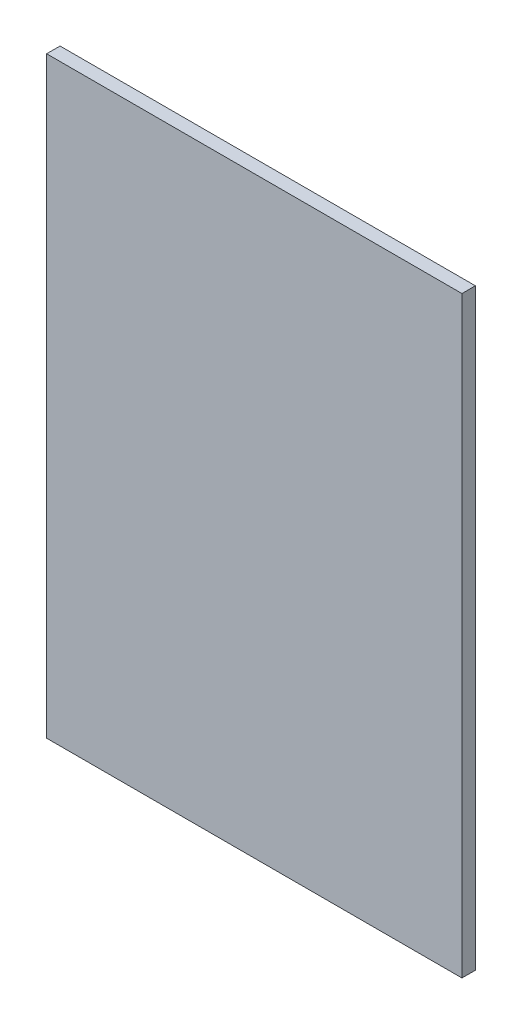
ISO-10303-21;
HEADER;
FILE_DESCRIPTION(('STEP AP214'),'2;1');
FILE_NAME('part.step','',(''),(''),'','','');
FILE_SCHEMA(('AUTOMOTIVE_DESIGN { 1 0 10303 214 1 1 1 1 }'));
ENDSEC;
DATA;
#1=APPLICATION_CONTEXT('core data for automotive mechanical design processes');
#2=APPLICATION_PROTOCOL_DEFINITION('international standard','automotive_design',2000,#1);
#3=PRODUCT_CONTEXT('',#1,'mechanical');
#4=PRODUCT('Part','Part','',(#3));
#5=PRODUCT_RELATED_PRODUCT_CATEGORY('part','',(#4));
#6=PRODUCT_DEFINITION_FORMATION('','',#4);
#7=PRODUCT_DEFINITION_CONTEXT('part definition',#1,'design');
#8=PRODUCT_DEFINITION('design','',#6,#7);
#9=PRODUCT_DEFINITION_SHAPE('','',#8);
#10=(LENGTH_UNIT() NAMED_UNIT(*) SI_UNIT(.MILLI.,.METRE.));
#11=(NAMED_UNIT(*) PLANE_ANGLE_UNIT() SI_UNIT($,.RADIAN.));
#12=(NAMED_UNIT(*) SI_UNIT($,.STERADIAN.) SOLID_ANGLE_UNIT());
#13=UNCERTAINTY_MEASURE_WITH_UNIT(LENGTH_MEASURE(1.E-05),#10,'distance_accuracy_value','');
#14=(GEOMETRIC_REPRESENTATION_CONTEXT(3) GLOBAL_UNCERTAINTY_ASSIGNED_CONTEXT((#13)) GLOBAL_UNIT_ASSIGNED_CONTEXT((#10,
#11,#12)) REPRESENTATION_CONTEXT('',''));
#15=CARTESIAN_POINT('',(0.,0.,0.));
#16=DIRECTION('',(0.,0.,1.));
#17=DIRECTION('',(1.,0.,0.));
#18=AXIS2_PLACEMENT_3D('',#15,#16,#17);
#19=CARTESIAN_POINT('',(94.9570007324219,93.4720001220703,0.));
#20=DIRECTION('',(1.,0.,0.));
#21=DIRECTION('',(0.,-1.,0.));
#22=AXIS2_PLACEMENT_3D('',#19,#20,#21);
#23=PLANE('',#22);
#24=DIRECTION('',(0.,-1.,0.));
#25=VECTOR('',#24,1.);
#26=CARTESIAN_POINT('',(94.9570007324219,93.4720001220703,0.03556));
#27=LINE('',#26,#25);
#28=CARTESIAN_POINT('',(94.9570007324219,93.4720001220703,0.03556));
#29=VERTEX_POINT('',#28);
#30=CARTESIAN_POINT('',(94.9570007324219,91.9020004272461,0.03556));
#31=VERTEX_POINT('',#30);
#32=EDGE_CURVE('E11',#29,#31,#27,.T.);
#33=ORIENTED_EDGE('',*,*,#32,.F.);
#34=DIRECTION('',(0.,0.,1.));
#35=VECTOR('',#34,1.);
#36=CARTESIAN_POINT('',(94.9570007324219,93.4720001220703,0.));
#37=LINE('',#36,#35);
#38=CARTESIAN_POINT('',(94.9570007324219,93.4720001220703,0.));
#39=VERTEX_POINT('',#38);
#40=EDGE_CURVE('E24',#39,#29,#37,.T.);
#41=ORIENTED_EDGE('',*,*,#40,.F.);
#42=DIRECTION('',(0.,-1.,0.));
#43=VECTOR('',#42,1.);
#44=CARTESIAN_POINT('',(94.9570007324219,93.4720001220703,0.));
#45=LINE('',#44,#43);
#46=CARTESIAN_POINT('',(94.9570007324219,91.9020004272461,0.));
#47=VERTEX_POINT('',#46);
#48=EDGE_CURVE('E75',#39,#47,#45,.T.);
#49=ORIENTED_EDGE('',*,*,#48,.T.);
#50=DIRECTION('',(0.,0.,1.));
#51=VECTOR('',#50,1.);
#52=CARTESIAN_POINT('',(94.9570007324219,91.9020004272461,0.));
#53=LINE('',#52,#51);
#54=EDGE_CURVE('E37',#47,#31,#53,.T.);
#55=ORIENTED_EDGE('',*,*,#54,.T.);
#56=EDGE_LOOP('',(#33,#41,#49,#55));
#57=FACE_BOUND('',#56,.T.);
#58=ADVANCED_FACE('F17',(#57),#23,.F.);
#59=CARTESIAN_POINT('',(94.9570007324219,91.9020004272461,0.));
#60=DIRECTION('',(0.,1.,0.));
#61=DIRECTION('',(1.,0.,0.));
#62=AXIS2_PLACEMENT_3D('',#59,#60,#61);
#63=PLANE('',#62);
#64=DIRECTION('',(1.,0.,0.));
#65=VECTOR('',#64,1.);
#66=CARTESIAN_POINT('',(94.9570007324219,91.9020004272461,0.03556));
#67=LINE('',#66,#65);
#68=CARTESIAN_POINT('',(96.056999206543,91.9020004272461,0.03556));
#69=VERTEX_POINT('',#68);
#70=EDGE_CURVE('E83',#31,#69,#67,.T.);
#71=ORIENTED_EDGE('',*,*,#70,.F.);
#72=ORIENTED_EDGE('',*,*,#54,.F.);
#73=DIRECTION('',(1.,0.,0.));
#74=VECTOR('',#73,1.);
#75=CARTESIAN_POINT('',(94.9570007324219,91.9020004272461,0.));
#76=LINE('',#75,#74);
#77=CARTESIAN_POINT('',(96.056999206543,91.9020004272461,0.));
#78=VERTEX_POINT('',#77);
#79=EDGE_CURVE('E81',#47,#78,#76,.T.);
#80=ORIENTED_EDGE('',*,*,#79,.T.);
#81=DIRECTION('',(0.,0.,1.));
#82=VECTOR('',#81,1.);
#83=CARTESIAN_POINT('',(96.056999206543,91.9020004272461,0.));
#84=LINE('',#83,#82);
#85=EDGE_CURVE('E67',#78,#69,#84,.T.);
#86=ORIENTED_EDGE('',*,*,#85,.T.);
#87=EDGE_LOOP('',(#71,#72,#80,#86));
#88=FACE_BOUND('',#87,.T.);
#89=ADVANCED_FACE('F89',(#88),#63,.F.);
#90=CARTESIAN_POINT('',(96.056999206543,91.9020004272461,0.));
#91=DIRECTION('',(-1.,0.,0.));
#92=DIRECTION('',(0.,1.,0.));
#93=AXIS2_PLACEMENT_3D('',#90,#91,#92);
#94=PLANE('',#93);
#95=DIRECTION('',(0.,1.,0.));
#96=VECTOR('',#95,1.);
#97=CARTESIAN_POINT('',(96.056999206543,91.9020004272461,0.03556));
#98=LINE('',#97,#96);
#99=CARTESIAN_POINT('',(96.056999206543,93.4720001220703,0.03556));
#100=VERTEX_POINT('',#99);
#101=EDGE_CURVE('E71',#69,#100,#98,.T.);
#102=ORIENTED_EDGE('',*,*,#101,.F.);
#103=ORIENTED_EDGE('',*,*,#85,.F.);
#104=DIRECTION('',(0.,1.,0.));
#105=VECTOR('',#104,1.);
#106=CARTESIAN_POINT('',(96.056999206543,91.9020004272461,0.));
#107=LINE('',#106,#105);
#108=CARTESIAN_POINT('',(96.056999206543,93.4720001220703,0.));
#109=VERTEX_POINT('',#108);
#110=EDGE_CURVE('E63',#78,#109,#107,.T.);
#111=ORIENTED_EDGE('',*,*,#110,.T.);
#112=DIRECTION('',(0.,0.,1.));
#113=VECTOR('',#112,1.);
#114=CARTESIAN_POINT('',(96.056999206543,93.4720001220703,0.));
#115=LINE('',#114,#113);
#116=EDGE_CURVE('E53',#109,#100,#115,.T.);
#117=ORIENTED_EDGE('',*,*,#116,.T.);
#118=EDGE_LOOP('',(#102,#103,#111,#117));
#119=FACE_BOUND('',#118,.T.);
#120=ADVANCED_FACE('F66',(#119),#94,.F.);
#121=CARTESIAN_POINT('',(96.056999206543,93.4720001220703,0.));
#122=DIRECTION('',(0.,-1.,0.));
#123=DIRECTION('',(-1.,0.,0.));
#124=AXIS2_PLACEMENT_3D('',#121,#122,#123);
#125=PLANE('',#124);
#126=DIRECTION('',(-1.,0.,0.));
#127=VECTOR('',#126,1.);
#128=CARTESIAN_POINT('',(96.056999206543,93.4720001220703,0.03556));
#129=LINE('',#128,#127);
#130=EDGE_CURVE('E59',#100,#29,#129,.T.);
#131=ORIENTED_EDGE('',*,*,#130,.F.);
#132=ORIENTED_EDGE('',*,*,#116,.F.);
#133=DIRECTION('',(-1.,0.,0.));
#134=VECTOR('',#133,1.);
#135=CARTESIAN_POINT('',(96.056999206543,93.4720001220703,0.));
#136=LINE('',#135,#134);
#137=EDGE_CURVE('E57',#109,#39,#136,.T.);
#138=ORIENTED_EDGE('',*,*,#137,.T.);
#139=ORIENTED_EDGE('',*,*,#40,.T.);
#140=EDGE_LOOP('',(#131,#132,#138,#139));
#141=FACE_BOUND('',#140,.T.);
#142=ADVANCED_FACE('F55',(#141),#125,.F.);
#143=CARTESIAN_POINT('',(94.9570007324219,93.4720001220703,0.));
#144=DIRECTION('',(0.,0.,-1.));
#145=DIRECTION('',(-1.,0.,0.));
#146=AXIS2_PLACEMENT_3D('',#143,#144,#145);
#147=PLANE('',#146);
#148=ORIENTED_EDGE('',*,*,#137,.F.);
#149=ORIENTED_EDGE('',*,*,#110,.F.);
#150=ORIENTED_EDGE('',*,*,#79,.F.);
#151=ORIENTED_EDGE('',*,*,#48,.F.);
#152=EDGE_LOOP('',(#148,#149,#150,#151));
#153=FACE_BOUND('',#152,.T.);
#154=ADVANCED_FACE('F74',(#153),#147,.T.);
#155=CARTESIAN_POINT('',(94.9570007324219,93.4720001220703,0.03556));
#156=DIRECTION('',(0.,0.,-1.));
#157=DIRECTION('',(-1.,0.,0.));
#158=AXIS2_PLACEMENT_3D('',#155,#156,#157);
#159=PLANE('',#158);
#160=ORIENTED_EDGE('',*,*,#32,.T.);
#161=ORIENTED_EDGE('',*,*,#70,.T.);
#162=ORIENTED_EDGE('',*,*,#101,.T.);
#163=ORIENTED_EDGE('',*,*,#130,.T.);
#164=EDGE_LOOP('',(#160,#161,#162,#163));
#165=FACE_BOUND('',#164,.T.);
#166=ADVANCED_FACE('F91',(#165),#159,.F.);
#167=CLOSED_SHELL('',(#58,#89,#120,#142,#154,#166));
#168=MANIFOLD_SOLID_BREP('B1',#167);
#169=ADVANCED_BREP_SHAPE_REPRESENTATION('',(#18,#168),#14);
#170=SHAPE_DEFINITION_REPRESENTATION(#9,#169);
ENDSEC;
END-ISO-10303-21;
